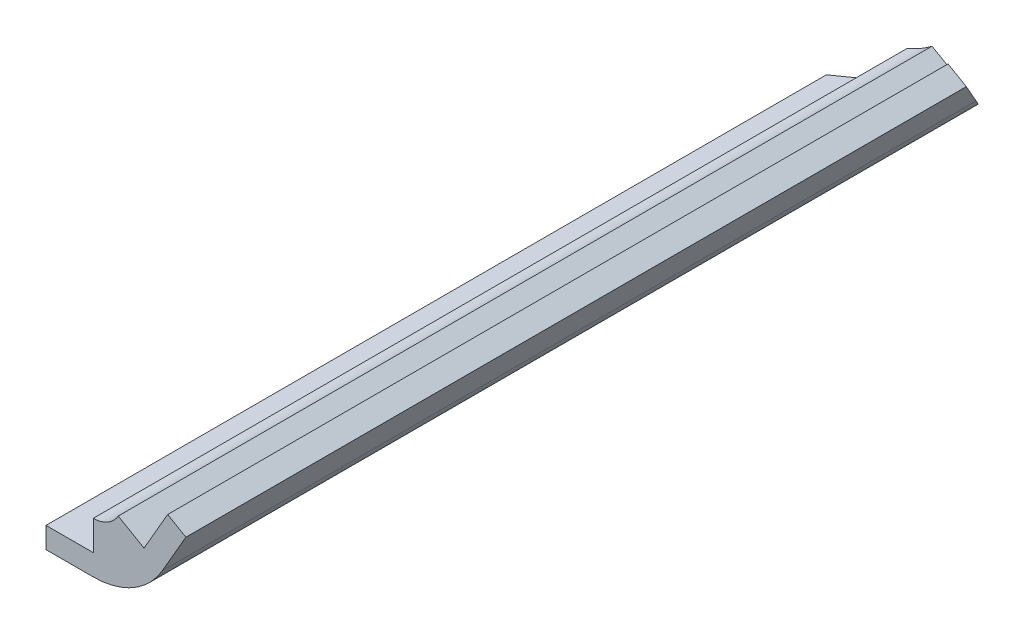
ISO-10303-21;
HEADER;
FILE_DESCRIPTION(('STEP AP214'),'2;1');
FILE_NAME('part.step','',(''),(''),'','','');
FILE_SCHEMA(('AUTOMOTIVE_DESIGN { 1 0 10303 214 1 1 1 1 }'));
ENDSEC;
DATA;
#1=APPLICATION_CONTEXT('core data for automotive mechanical design processes');
#2=APPLICATION_PROTOCOL_DEFINITION('international standard','automotive_design',2000,#1);
#3=PRODUCT_CONTEXT('',#1,'mechanical');
#4=PRODUCT('Part','Part','',(#3));
#5=PRODUCT_RELATED_PRODUCT_CATEGORY('part','',(#4));
#6=PRODUCT_DEFINITION_FORMATION('','',#4);
#7=PRODUCT_DEFINITION_CONTEXT('part definition',#1,'design');
#8=PRODUCT_DEFINITION('design','',#6,#7);
#9=PRODUCT_DEFINITION_SHAPE('','',#8);
#10=(LENGTH_UNIT() NAMED_UNIT(*) SI_UNIT(.MILLI.,.METRE.));
#11=(NAMED_UNIT(*) PLANE_ANGLE_UNIT() SI_UNIT($,.RADIAN.));
#12=(NAMED_UNIT(*) SI_UNIT($,.STERADIAN.) SOLID_ANGLE_UNIT());
#13=UNCERTAINTY_MEASURE_WITH_UNIT(LENGTH_MEASURE(1.E-05),#10,'distance_accuracy_value','');
#14=(GEOMETRIC_REPRESENTATION_CONTEXT(3) GLOBAL_UNCERTAINTY_ASSIGNED_CONTEXT((#13)) GLOBAL_UNIT_ASSIGNED_CONTEXT((#10,
#11,#12)) REPRESENTATION_CONTEXT('',''));
#15=CARTESIAN_POINT('',(0.,0.,0.));
#16=DIRECTION('',(0.,0.,1.));
#17=DIRECTION('',(1.,0.,0.));
#18=AXIS2_PLACEMENT_3D('',#15,#16,#17);
#19=CARTESIAN_POINT('',(-7.3025,-1.500000048,130.175));
#20=DIRECTION('',(1.,0.,0.));
#21=DIRECTION('',(0.,0.,-1.));
#22=AXIS2_PLACEMENT_3D('',#19,#20,#21);
#23=PLANE('',#22);
#24=DIRECTION('',(0.,0.,-1.));
#25=VECTOR('',#24,1.);
#26=CARTESIAN_POINT('',(-7.3025,-1.500000048,130.175));
#27=LINE('',#26,#25);
#28=CARTESIAN_POINT('',(-7.3025,-1.500000048,130.175));
#29=VERTEX_POINT('',#28);
#30=CARTESIAN_POINT('',(-7.3025,-1.500000048,51.5834693305167));
#31=VERTEX_POINT('',#30);
#32=EDGE_CURVE('E195',#29,#31,#27,.T.);
#33=ORIENTED_EDGE('',*,*,#32,.T.);
#34=DIRECTION('',(0.,-1.,0.));
#35=VECTOR('',#34,1.);
#36=CARTESIAN_POINT('',(-7.3025,-1.50000004800005,51.5834693305167));
#37=LINE('',#36,#35);
#38=CARTESIAN_POINT('',(-7.3025,-3.621225168,51.5834693305167));
#39=VERTEX_POINT('',#38);
#40=EDGE_CURVE('E148',#31,#39,#37,.T.);
#41=ORIENTED_EDGE('',*,*,#40,.T.);
#42=DIRECTION('',(0.,0.,-1.));
#43=VECTOR('',#42,1.);
#44=CARTESIAN_POINT('',(-7.3025,-3.621225168,130.175));
#45=LINE('',#44,#43);
#46=CARTESIAN_POINT('',(-7.3025,-3.621225168,130.175));
#47=VERTEX_POINT('',#46);
#48=EDGE_CURVE('E204',#47,#39,#45,.T.);
#49=ORIENTED_EDGE('',*,*,#48,.F.);
#50=DIRECTION('',(0.,-1.,0.));
#51=VECTOR('',#50,1.);
#52=CARTESIAN_POINT('',(-7.3025,-1.500000048,130.175));
#53=LINE('',#52,#51);
#54=EDGE_CURVE('E189',#29,#47,#53,.T.);
#55=ORIENTED_EDGE('',*,*,#54,.F.);
#56=EDGE_LOOP('',(#33,#41,#49,#55));
#57=FACE_BOUND('',#56,.T.);
#58=ADVANCED_FACE('F41',(#57),#23,.F.);
#59=CARTESIAN_POINT('',(-7.3025,-3.621225168,130.175));
#60=DIRECTION('',(0.,1.,0.));
#61=DIRECTION('',(0.,0.,1.));
#62=AXIS2_PLACEMENT_3D('',#59,#60,#61);
#63=PLANE('',#62);
#64=ORIENTED_EDGE('',*,*,#48,.T.);
#65=DIRECTION('',(0.816496580927727,0.,-0.577350269189625));
#66=VECTOR('',#65,1.);
#67=CARTESIAN_POINT('',(-44.3509028534814,-3.621225168,77.7806462203444));
#68=LINE('',#67,#66);
#69=CARTESIAN_POINT('',(-2.54,-3.621225168,48.2158732851159));
#70=VERTEX_POINT('',#69);
#71=EDGE_CURVE('E145',#39,#70,#68,.T.);
#72=ORIENTED_EDGE('',*,*,#71,.T.);
#73=DIRECTION('',(0.,0.,-1.));
#74=VECTOR('',#73,1.);
#75=CARTESIAN_POINT('',(-2.54,-3.621225168,130.175));
#76=LINE('',#75,#74);
#77=CARTESIAN_POINT('',(-2.54,-3.621225168,130.175));
#78=VERTEX_POINT('',#77);
#79=EDGE_CURVE('E201',#78,#70,#76,.T.);
#80=ORIENTED_EDGE('',*,*,#79,.F.);
#81=DIRECTION('',(1.,0.,0.));
#82=VECTOR('',#81,1.);
#83=CARTESIAN_POINT('',(-7.3025,-3.621225168,130.175));
#84=LINE('',#83,#82);
#85=EDGE_CURVE('E191',#47,#78,#84,.T.);
#86=ORIENTED_EDGE('',*,*,#85,.F.);
#87=EDGE_LOOP('',(#64,#72,#80,#86));
#88=FACE_BOUND('',#87,.T.);
#89=ADVANCED_FACE('F233',(#88),#63,.F.);
#90=CARTESIAN_POINT('',(-7.3025,-1.500000048,130.175));
#91=DIRECTION('',(0.,-1.,0.));
#92=DIRECTION('',(1.,0.,0.));
#93=AXIS2_PLACEMENT_3D('',#90,#91,#92);
#94=PLANE('',#93);
#95=DIRECTION('',(0.,0.,-1.));
#96=VECTOR('',#95,1.);
#97=CARTESIAN_POINT('',(-2.54,-1.500000048,130.175));
#98=LINE('',#97,#96);
#99=CARTESIAN_POINT('',(-2.54,-1.500000048,130.175));
#100=VERTEX_POINT('',#99);
#101=CARTESIAN_POINT('',(-2.53999999999999,-1.500000048,48.2158732851158));
#102=VERTEX_POINT('',#101);
#103=EDGE_CURVE('E198',#100,#102,#98,.T.);
#104=ORIENTED_EDGE('',*,*,#103,.T.);
#105=DIRECTION('',(-0.816496580927727,0.,0.577350269189625));
#106=VECTOR('',#105,1.);
#107=CARTESIAN_POINT('',(-44.3509028534814,-1.50000004799999,77.7806462203444));
#108=LINE('',#107,#106);
#109=EDGE_CURVE('E156',#102,#31,#108,.T.);
#110=ORIENTED_EDGE('',*,*,#109,.T.);
#111=ORIENTED_EDGE('',*,*,#32,.F.);
#112=DIRECTION('',(-1.,0.,0.));
#113=VECTOR('',#112,1.);
#114=CARTESIAN_POINT('',(-7.3025,-1.500000048,130.175));
#115=LINE('',#114,#113);
#116=EDGE_CURVE('E63',#100,#29,#115,.T.);
#117=ORIENTED_EDGE('',*,*,#116,.F.);
#118=EDGE_LOOP('',(#104,#110,#111,#117));
#119=FACE_BOUND('',#118,.T.);
#120=ADVANCED_FACE('F238',(#119),#94,.F.);
#121=CARTESIAN_POINT('',(0.,0.,130.175));
#122=DIRECTION('',(0.,0.,1.));
#123=DIRECTION('',(1.,0.,0.));
#124=AXIS2_PLACEMENT_3D('',#121,#122,#123);
#125=PLANE('',#124);
#126=DIRECTION('',(-0.499999999999998,-0.86602540378444,0.));
#127=VECTOR('',#126,1.);
#128=CARTESIAN_POINT('',(4.95028814724586,5.57415048713588,130.175));
#129=LINE('',#128,#127);
#130=CARTESIAN_POINT('',(4.95028814724586,5.57415048713588,130.175));
#131=VERTEX_POINT('',#130);
#132=CARTESIAN_POINT('',(2.56903814724587,1.44970450161248,130.175));
#133=VERTEX_POINT('',#132);
#134=EDGE_CURVE('E170',#131,#133,#129,.T.);
#135=ORIENTED_EDGE('',*,*,#134,.T.);
#136=DIRECTION('',(-0.86602540378444,0.499999999999998,0.));
#137=VECTOR('',#136,1.);
#138=CARTESIAN_POINT('',(2.56903814724587,1.44970450161248,130.175));
#139=LINE('',#138,#137);
#140=CARTESIAN_POINT('',(-0.0290381472458851,2.94970454961247,130.175));
#141=VERTEX_POINT('',#140);
#142=EDGE_CURVE('E172',#133,#141,#139,.T.);
#143=ORIENTED_EDGE('',*,*,#142,.T.);
#144=CARTESIAN_POINT('',(-2.54,4.39940905122494,130.175));
#145=DIRECTION('',(0.,0.,-1.));
#146=DIRECTION('',(-1.,0.,0.));
#147=AXIS2_PLACEMENT_3D('',#144,#145,#146);
#148=CIRCLE('',#147,2.89940900322494);
#149=CARTESIAN_POINT('',(-2.54,1.500000048,130.175));
#150=VERTEX_POINT('',#149);
#151=EDGE_CURVE('E133',#141,#150,#148,.T.);
#152=ORIENTED_EDGE('',*,*,#151,.T.);
#153=DIRECTION('',(0.,-1.,0.));
#154=VECTOR('',#153,1.);
#155=CARTESIAN_POINT('',(-2.54,1.500000048,130.175));
#156=LINE('',#155,#154);
#157=EDGE_CURVE('E162',#150,#100,#156,.T.);
#158=ORIENTED_EDGE('',*,*,#157,.T.);
#159=ORIENTED_EDGE('',*,*,#116,.T.);
#160=ORIENTED_EDGE('',*,*,#54,.T.);
#161=ORIENTED_EDGE('',*,*,#85,.T.);
#162=CARTESIAN_POINT('',(-2.54,4.39940905122494,130.175));
#163=DIRECTION('',(0.,0.,1.));
#164=DIRECTION('',(-1.,0.,0.));
#165=AXIS2_PLACEMENT_3D('',#162,#163,#164);
#166=CIRCLE('',#165,8.02063421922494);
#167=CARTESIAN_POINT('',(4.40607298831157,0.389091941612482,130.175));
#168=VERTEX_POINT('',#167);
#169=EDGE_CURVE('E164',#78,#168,#166,.T.);
#170=ORIENTED_EDGE('',*,*,#169,.T.);
#171=DIRECTION('',(0.499999999999998,0.86602540378444,0.));
#172=VECTOR('',#171,1.);
#173=CARTESIAN_POINT('',(6.78732298831156,4.51353792713588,130.175));
#174=LINE('',#173,#172);
#175=CARTESIAN_POINT('',(6.78732298831156,4.51353792713588,130.175));
#176=VERTEX_POINT('',#175);
#177=EDGE_CURVE('E166',#168,#176,#174,.T.);
#178=ORIENTED_EDGE('',*,*,#177,.T.);
#179=DIRECTION('',(-0.86602540378444,0.499999999999997,0.));
#180=VECTOR('',#179,1.);
#181=CARTESIAN_POINT('',(6.78732298831156,4.51353792713588,130.175));
#182=LINE('',#181,#180);
#183=EDGE_CURVE('E168',#176,#131,#182,.T.);
#184=ORIENTED_EDGE('',*,*,#183,.T.);
#185=EDGE_LOOP('',(#135,#143,#152,#158,#159,#160,#161,#170,#178,#184));
#186=FACE_BOUND('',#185,.T.);
#187=ADVANCED_FACE('F228',(#186),#125,.T.);
#188=CARTESIAN_POINT('',(-2.54,4.39940905122494,130.175));
#189=DIRECTION('',(0.,0.,-1.));
#190=DIRECTION('',(-1.,0.,0.));
#191=AXIS2_PLACEMENT_3D('',#188,#189,#190);
#192=CYLINDRICAL_SURFACE('',#191,2.89940900322494);
#193=DIRECTION('',(0.,0.,-1.));
#194=VECTOR('',#193,1.);
#195=CARTESIAN_POINT('',(-0.0290381472458851,2.94970454961247,130.175));
#196=LINE('',#195,#194);
#197=CARTESIAN_POINT('',(-0.0290381472458851,2.94970454961247,48.215873285116));
#198=VERTEX_POINT('',#197);
#199=EDGE_CURVE('E144',#141,#198,#196,.T.);
#200=ORIENTED_EDGE('',*,*,#199,.T.);
#201=CARTESIAN_POINT('',(-2.54,4.39940905122494,48.215873285116));
#202=DIRECTION('',(-0.288675134594813,-0.500000000000001,0.816496580927725));
#203=DIRECTION('',(-0.408248290463863,-0.707106781186547,-0.577350269189627));
#204=AXIS2_PLACEMENT_3D('',#201,#202,#203);
#205=ELLIPSE('',#204,3.55103630676634,2.89940900322494);
#206=CARTESIAN_POINT('',(-1.09029549838764,1.88844719847076,47.1907774013091));
#207=VERTEX_POINT('',#206);
#208=EDGE_CURVE('E55',#198,#207,#205,.F.);
#209=ORIENTED_EDGE('',*,*,#208,.T.);
#210=CARTESIAN_POINT('',(-2.54,4.39940905122494,48.2158732851159));
#211=DIRECTION('',(0.577350269189625,0.,0.816496580927727));
#212=DIRECTION('',(0.816496580927727,0.,-0.577350269189625));
#213=AXIS2_PLACEMENT_3D('',#210,#211,#212);
#214=ELLIPSE('',#213,3.55103630676634,2.89940900322494);
#215=CARTESIAN_POINT('',(-2.54,1.500000048,48.2158732851158));
#216=VERTEX_POINT('',#215);
#217=EDGE_CURVE('E125',#207,#216,#214,.F.);
#218=ORIENTED_EDGE('',*,*,#217,.T.);
#219=DIRECTION('',(0.,0.,-1.));
#220=VECTOR('',#219,1.);
#221=CARTESIAN_POINT('',(-2.54,1.500000048,130.175));
#222=LINE('',#221,#220);
#223=EDGE_CURVE('E187',#150,#216,#222,.T.);
#224=ORIENTED_EDGE('',*,*,#223,.F.);
#225=ORIENTED_EDGE('',*,*,#151,.F.);
#226=EDGE_LOOP('',(#200,#209,#218,#224,#225));
#227=FACE_BOUND('',#226,.T.);
#228=ADVANCED_FACE('F141',(#227),#192,.F.);
#229=CARTESIAN_POINT('',(-2.54,1.500000048,130.175));
#230=DIRECTION('',(1.,0.,0.));
#231=DIRECTION('',(0.,0.,-1.));
#232=AXIS2_PLACEMENT_3D('',#229,#230,#231);
#233=PLANE('',#232);
#234=ORIENTED_EDGE('',*,*,#223,.T.);
#235=DIRECTION('',(0.,-1.,0.));
#236=VECTOR('',#235,1.);
#237=CARTESIAN_POINT('',(-2.54,1.50000004799994,48.2158732851158));
#238=LINE('',#237,#236);
#239=EDGE_CURVE('E129',#216,#102,#238,.T.);
#240=ORIENTED_EDGE('',*,*,#239,.T.);
#241=ORIENTED_EDGE('',*,*,#103,.F.);
#242=ORIENTED_EDGE('',*,*,#157,.F.);
#243=EDGE_LOOP('',(#234,#240,#241,#242));
#244=FACE_BOUND('',#243,.T.);
#245=ADVANCED_FACE('F241',(#244),#233,.F.);
#246=CARTESIAN_POINT('',(-2.54,4.39940905122494,130.175));
#247=DIRECTION('',(0.,0.,-1.));
#248=DIRECTION('',(-1.,0.,0.));
#249=AXIS2_PLACEMENT_3D('',#246,#247,#248);
#250=CYLINDRICAL_SURFACE('',#249,8.02063421922494);
#251=CARTESIAN_POINT('',(-2.54,4.39940905122494,48.2158732851159));
#252=DIRECTION('',(0.577350269189625,0.,0.816496580927727));
#253=DIRECTION('',(0.816496580927727,0.,-0.577350269189625));
#254=AXIS2_PLACEMENT_3D('',#251,#252,#253);
#255=ELLIPSE('',#254,9.82323062530361,8.02063421922494);
#256=CARTESIAN_POINT('',(1.47031710961237,-2.54666393708669,45.3801508622005));
#257=VERTEX_POINT('',#256);
#258=EDGE_CURVE('E11',#70,#257,#255,.T.);
#259=ORIENTED_EDGE('',*,*,#258,.T.);
#260=CARTESIAN_POINT('',(-2.54,4.39940905122494,48.215873285116));
#261=DIRECTION('',(-0.288675134594813,-0.500000000000001,0.816496580927725));
#262=DIRECTION('',(-0.408248290463863,-0.707106781186547,-0.577350269189627));
#263=AXIS2_PLACEMENT_3D('',#260,#261,#262);
#264=ELLIPSE('',#263,9.82323062530363,8.02063421922494);
#265=CARTESIAN_POINT('',(4.40607298831157,0.389091941612477,48.215873285116));
#266=VERTEX_POINT('',#265);
#267=EDGE_CURVE('E137',#257,#266,#264,.T.);
#268=ORIENTED_EDGE('',*,*,#267,.T.);
#269=DIRECTION('',(0.,0.,-1.));
#270=VECTOR('',#269,1.);
#271=CARTESIAN_POINT('',(4.40607298831157,0.389091941612482,130.175));
#272=LINE('',#271,#270);
#273=EDGE_CURVE('E184',#168,#266,#272,.T.);
#274=ORIENTED_EDGE('',*,*,#273,.F.);
#275=ORIENTED_EDGE('',*,*,#169,.F.);
#276=ORIENTED_EDGE('',*,*,#79,.T.);
#277=EDGE_LOOP('',(#259,#268,#274,#275,#276));
#278=FACE_BOUND('',#277,.T.);
#279=ADVANCED_FACE('F231',(#278),#250,.T.);
#280=CARTESIAN_POINT('',(6.78732298831156,4.51353792713588,130.175));
#281=DIRECTION('',(-0.86602540378444,0.499999999999998,0.));
#282=DIRECTION('',(-0.499999999999998,-0.86602540378444,0.));
#283=AXIS2_PLACEMENT_3D('',#280,#281,#282);
#284=PLANE('',#283);
#285=ORIENTED_EDGE('',*,*,#273,.T.);
#286=DIRECTION('',(0.408248290463861,0.707106781186548,0.577350269189627));
#287=VECTOR('',#286,1.);
#288=CARTESIAN_POINT('',(25.3115244150522,36.5983959678906,77.7806462203447));
#289=LINE('',#288,#287);
#290=CARTESIAN_POINT('',(6.78732298831156,4.51353792713588,51.583469330517));
#291=VERTEX_POINT('',#290);
#292=EDGE_CURVE('E150',#266,#291,#289,.T.);
#293=ORIENTED_EDGE('',*,*,#292,.T.);
#294=DIRECTION('',(0.,0.,-1.));
#295=VECTOR('',#294,1.);
#296=CARTESIAN_POINT('',(6.78732298831156,4.51353792713588,130.175));
#297=LINE('',#296,#295);
#298=EDGE_CURVE('E181',#176,#291,#297,.T.);
#299=ORIENTED_EDGE('',*,*,#298,.F.);
#300=ORIENTED_EDGE('',*,*,#177,.F.);
#301=EDGE_LOOP('',(#285,#293,#299,#300));
#302=FACE_BOUND('',#301,.T.);
#303=ADVANCED_FACE('F222',(#302),#284,.F.);
#304=CARTESIAN_POINT('',(6.78732298831156,4.51353792713588,130.175));
#305=DIRECTION('',(-0.499999999999997,-0.86602540378444,0.));
#306=DIRECTION('',(0.86602540378444,-0.499999999999997,0.));
#307=AXIS2_PLACEMENT_3D('',#304,#305,#306);
#308=PLANE('',#307);
#309=ORIENTED_EDGE('',*,*,#298,.T.);
#310=DIRECTION('',(-0.86602540378444,0.499999999999997,0.));
#311=VECTOR('',#310,1.);
#312=CARTESIAN_POINT('',(6.78732298831172,4.51353792713579,51.583469330517));
#313=LINE('',#312,#311);
#314=CARTESIAN_POINT('',(4.95028814724587,5.57415048713587,51.583469330517));
#315=VERTEX_POINT('',#314);
#316=EDGE_CURVE('E216',#291,#315,#313,.T.);
#317=ORIENTED_EDGE('',*,*,#316,.T.);
#318=DIRECTION('',(0.,0.,-1.));
#319=VECTOR('',#318,1.);
#320=CARTESIAN_POINT('',(4.95028814724586,5.57415048713588,130.175));
#321=LINE('',#320,#319);
#322=EDGE_CURVE('E178',#131,#315,#321,.T.);
#323=ORIENTED_EDGE('',*,*,#322,.F.);
#324=ORIENTED_EDGE('',*,*,#183,.F.);
#325=EDGE_LOOP('',(#309,#317,#323,#324));
#326=FACE_BOUND('',#325,.T.);
#327=ADVANCED_FACE('F227',(#326),#308,.F.);
#328=CARTESIAN_POINT('',(4.95028814724586,5.57415048713588,130.175));
#329=DIRECTION('',(0.86602540378444,-0.499999999999998,0.));
#330=DIRECTION('',(0.499999999999998,0.86602540378444,0.));
#331=AXIS2_PLACEMENT_3D('',#328,#329,#330);
#332=PLANE('',#331);
#333=ORIENTED_EDGE('',*,*,#322,.T.);
#334=DIRECTION('',(-0.408248290463861,-0.707106781186548,-0.577350269189627));
#335=VECTOR('',#334,1.);
#336=CARTESIAN_POINT('',(23.4744895739864,37.6590085278906,77.7806462203447));
#337=LINE('',#336,#335);
#338=CARTESIAN_POINT('',(2.56903814724587,1.44970450161248,48.215873285116));
#339=VERTEX_POINT('',#338);
#340=EDGE_CURVE('E138',#315,#339,#337,.T.);
#341=ORIENTED_EDGE('',*,*,#340,.T.);
#342=DIRECTION('',(0.,0.,-1.));
#343=VECTOR('',#342,1.);
#344=CARTESIAN_POINT('',(2.56903814724587,1.44970450161248,130.175));
#345=LINE('',#344,#343);
#346=EDGE_CURVE('E175',#133,#339,#345,.T.);
#347=ORIENTED_EDGE('',*,*,#346,.F.);
#348=ORIENTED_EDGE('',*,*,#134,.F.);
#349=EDGE_LOOP('',(#333,#341,#347,#348));
#350=FACE_BOUND('',#349,.T.);
#351=ADVANCED_FACE('F213',(#350),#332,.F.);
#352=CARTESIAN_POINT('',(2.56903814724587,1.44970450161248,130.175));
#353=DIRECTION('',(-0.499999999999997,-0.86602540378444,0.));
#354=DIRECTION('',(0.86602540378444,-0.499999999999998,0.));
#355=AXIS2_PLACEMENT_3D('',#352,#353,#354);
#356=PLANE('',#355);
#357=ORIENTED_EDGE('',*,*,#346,.T.);
#358=DIRECTION('',(-0.86602540378444,0.499999999999997,0.));
#359=VECTOR('',#358,1.);
#360=CARTESIAN_POINT('',(2.56903814724601,1.4497045016124,48.215873285116));
#361=LINE('',#360,#359);
#362=EDGE_CURVE('E48',#339,#198,#361,.T.);
#363=ORIENTED_EDGE('',*,*,#362,.T.);
#364=ORIENTED_EDGE('',*,*,#199,.F.);
#365=ORIENTED_EDGE('',*,*,#142,.F.);
#366=EDGE_LOOP('',(#357,#363,#364,#365));
#367=FACE_BOUND('',#366,.T.);
#368=ADVANCED_FACE('F207',(#367),#356,.F.);
#369=CARTESIAN_POINT('',(-220.129125807328,-146.654256022981,202.07461965593));
#370=DIRECTION('',(0.577350269189625,0.,0.816496580927727));
#371=DIRECTION('',(0.816496580927727,0.,-0.577350269189625));
#372=AXIS2_PLACEMENT_3D('',#369,#370,#371);
#373=PLANE('',#372);
#374=DIRECTION('',(0.471404520791034,-0.816496580927725,-0.333333333333333));
#375=VECTOR('',#374,1.);
#376=CARTESIAN_POINT('',(-16.9291258073282,29.3221060260175,58.3905217188239));
#377=LINE('',#376,#375);
#378=EDGE_CURVE('E127',#207,#257,#377,.T.);
#379=ORIENTED_EDGE('',*,*,#378,.T.);
#380=ORIENTED_EDGE('',*,*,#258,.F.);
#381=ORIENTED_EDGE('',*,*,#71,.F.);
#382=ORIENTED_EDGE('',*,*,#40,.F.);
#383=ORIENTED_EDGE('',*,*,#109,.F.);
#384=ORIENTED_EDGE('',*,*,#239,.F.);
#385=ORIENTED_EDGE('',*,*,#217,.F.);
#386=EDGE_LOOP('',(#379,#380,#381,#382,#383,#384,#385));
#387=FACE_BOUND('',#386,.T.);
#388=ADVANCED_FACE('F126',(#387),#373,.F.);
#389=CARTESIAN_POINT('',(-16.9291258073282,29.3221060260175,58.3905217188239));
#390=DIRECTION('',(-0.288675134594813,-0.500000000000001,0.816496580927725));
#391=DIRECTION('',(0.,-0.852802865422441,-0.522232967867094));
#392=AXIS2_PLACEMENT_3D('',#389,#390,#391);
#393=PLANE('',#392);
#394=ORIENTED_EDGE('',*,*,#362,.F.);
#395=ORIENTED_EDGE('',*,*,#340,.F.);
#396=ORIENTED_EDGE('',*,*,#316,.F.);
#397=ORIENTED_EDGE('',*,*,#292,.F.);
#398=ORIENTED_EDGE('',*,*,#267,.F.);
#399=ORIENTED_EDGE('',*,*,#378,.F.);
#400=ORIENTED_EDGE('',*,*,#208,.F.);
#401=EDGE_LOOP('',(#394,#395,#396,#397,#398,#399,#400));
#402=FACE_BOUND('',#401,.T.);
#403=ADVANCED_FACE('F135',(#402),#393,.F.);
#404=CLOSED_SHELL('',(#58,#89,#120,#187,#228,#245,#279,#303,#327,#351,#368,#388,#403));
#405=MANIFOLD_SOLID_BREP('B2',#404);
#406=ADVANCED_BREP_SHAPE_REPRESENTATION('',(#18,#405),#14);
#407=SHAPE_DEFINITION_REPRESENTATION(#9,#406);
ENDSEC;
END-ISO-10303-21;
